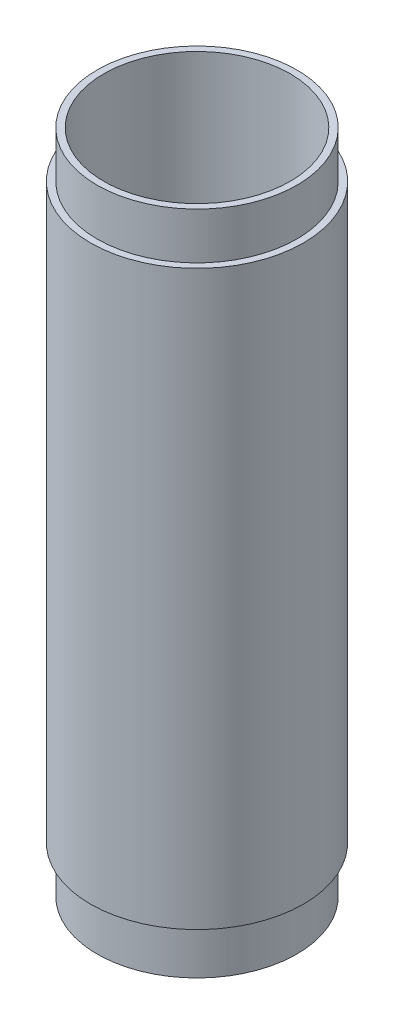
ISO-10303-21;
HEADER;
FILE_DESCRIPTION(('STEP AP214'),'2;1');
FILE_NAME('part.step','',(''),(''),'','','');
FILE_SCHEMA(('AUTOMOTIVE_DESIGN { 1 0 10303 214 1 1 1 1 }'));
ENDSEC;
DATA;
#1=APPLICATION_CONTEXT('core data for automotive mechanical design processes');
#2=APPLICATION_PROTOCOL_DEFINITION('international standard','automotive_design',2000,#1);
#3=PRODUCT_CONTEXT('',#1,'mechanical');
#4=PRODUCT('Part','Part','',(#3));
#5=PRODUCT_RELATED_PRODUCT_CATEGORY('part','',(#4));
#6=PRODUCT_DEFINITION_FORMATION('','',#4);
#7=PRODUCT_DEFINITION_CONTEXT('part definition',#1,'design');
#8=PRODUCT_DEFINITION('design','',#6,#7);
#9=PRODUCT_DEFINITION_SHAPE('','',#8);
#10=(LENGTH_UNIT() NAMED_UNIT(*) SI_UNIT(.MILLI.,.METRE.));
#11=(NAMED_UNIT(*) PLANE_ANGLE_UNIT() SI_UNIT($,.RADIAN.));
#12=(NAMED_UNIT(*) SI_UNIT($,.STERADIAN.) SOLID_ANGLE_UNIT());
#13=UNCERTAINTY_MEASURE_WITH_UNIT(LENGTH_MEASURE(1.E-05),#10,'distance_accuracy_value','');
#14=(GEOMETRIC_REPRESENTATION_CONTEXT(3) GLOBAL_UNCERTAINTY_ASSIGNED_CONTEXT((#13)) GLOBAL_UNIT_ASSIGNED_CONTEXT((#10,
#11,#12)) REPRESENTATION_CONTEXT('',''));
#15=CARTESIAN_POINT('',(0.,0.,0.));
#16=DIRECTION('',(0.,0.,1.));
#17=DIRECTION('',(1.,0.,0.));
#18=AXIS2_PLACEMENT_3D('',#15,#16,#17);
#19=CARTESIAN_POINT('',(0.,100.,0.));
#20=DIRECTION('',(0.,-1.,0.));
#21=DIRECTION('',(0.,0.,-1.));
#22=AXIS2_PLACEMENT_3D('',#19,#20,#21);
#23=CYLINDRICAL_SURFACE('',#22,16.);
#24=CARTESIAN_POINT('',(0.,7.00000000000001,0.));
#25=DIRECTION('',(0.,-1.,0.));
#26=DIRECTION('',(0.,0.,-1.));
#27=AXIS2_PLACEMENT_3D('',#24,#25,#26);
#28=CIRCLE('',#27,16.);
#29=CARTESIAN_POINT('',(0.,7.00000000000001,-16.));
#30=VERTEX_POINT('',#29);
#31=EDGE_CURVE('E18',#30,#30,#28,.T.);
#32=ORIENTED_EDGE('',*,*,#31,.F.);
#33=EDGE_LOOP('',(#32));
#34=FACE_BOUND('',#33,.T.);
#35=CARTESIAN_POINT('',(0.,93.,0.));
#36=DIRECTION('',(0.,-1.,0.));
#37=DIRECTION('',(0.,0.,-1.));
#38=AXIS2_PLACEMENT_3D('',#35,#36,#37);
#39=CIRCLE('',#38,16.);
#40=CARTESIAN_POINT('',(0.,93.,-16.));
#41=VERTEX_POINT('',#40);
#42=EDGE_CURVE('E40',#41,#41,#39,.F.);
#43=ORIENTED_EDGE('',*,*,#42,.F.);
#44=EDGE_LOOP('',(#43));
#45=FACE_BOUND('',#44,.T.);
#46=ADVANCED_FACE('F15',(#34,#45),#23,.T.);
#47=CARTESIAN_POINT('',(0.,7.,0.));
#48=DIRECTION('',(0.,-1.,0.));
#49=DIRECTION('',(0.,0.,-1.));
#50=AXIS2_PLACEMENT_3D('',#47,#48,#49);
#51=PLANE('',#50);
#52=ORIENTED_EDGE('',*,*,#31,.T.);
#53=EDGE_LOOP('',(#52));
#54=FACE_BOUND('',#53,.T.);
#55=CARTESIAN_POINT('',(0.,7.,0.));
#56=DIRECTION('',(0.,-1.,0.));
#57=DIRECTION('',(0.,0.,-1.));
#58=AXIS2_PLACEMENT_3D('',#55,#56,#57);
#59=CIRCLE('',#58,15.);
#60=CARTESIAN_POINT('',(0.,7.,-15.));
#61=VERTEX_POINT('',#60);
#62=EDGE_CURVE('E38',#61,#61,#59,.T.);
#63=ORIENTED_EDGE('',*,*,#62,.F.);
#64=EDGE_LOOP('',(#63));
#65=FACE_BOUND('',#64,.T.);
#66=ADVANCED_FACE('F47',(#54,#65),#51,.T.);
#67=CARTESIAN_POINT('',(0.,93.,0.));
#68=DIRECTION('',(0.,1.,0.));
#69=DIRECTION('',(0.,0.,1.));
#70=AXIS2_PLACEMENT_3D('',#67,#68,#69);
#71=PLANE('',#70);
#72=ORIENTED_EDGE('',*,*,#42,.T.);
#73=EDGE_LOOP('',(#72));
#74=FACE_BOUND('',#73,.T.);
#75=CARTESIAN_POINT('',(0.,93.,0.));
#76=DIRECTION('',(0.,1.,0.));
#77=DIRECTION('',(0.,0.,1.));
#78=AXIS2_PLACEMENT_3D('',#75,#76,#77);
#79=CIRCLE('',#78,15.);
#80=CARTESIAN_POINT('',(0.,93.,15.));
#81=VERTEX_POINT('',#80);
#82=EDGE_CURVE('E35',#81,#81,#79,.T.);
#83=ORIENTED_EDGE('',*,*,#82,.F.);
#84=EDGE_LOOP('',(#83));
#85=FACE_BOUND('',#84,.T.);
#86=ADVANCED_FACE('F55',(#74,#85),#71,.T.);
#87=CARTESIAN_POINT('',(0.,7.,0.));
#88=DIRECTION('',(0.,-1.,0.));
#89=DIRECTION('',(0.,0.,-1.));
#90=AXIS2_PLACEMENT_3D('',#87,#88,#89);
#91=CYLINDRICAL_SURFACE('',#90,15.);
#92=CARTESIAN_POINT('',(0.,0.,0.));
#93=DIRECTION('',(0.,-1.,0.));
#94=DIRECTION('',(0.,0.,-1.));
#95=AXIS2_PLACEMENT_3D('',#92,#93,#94);
#96=CIRCLE('',#95,15.);
#97=CARTESIAN_POINT('',(0.,0.,-15.));
#98=VERTEX_POINT('',#97);
#99=EDGE_CURVE('E32',#98,#98,#96,.F.);
#100=ORIENTED_EDGE('',*,*,#99,.T.);
#101=EDGE_LOOP('',(#100));
#102=FACE_BOUND('',#101,.T.);
#103=ORIENTED_EDGE('',*,*,#62,.T.);
#104=EDGE_LOOP('',(#103));
#105=FACE_BOUND('',#104,.T.);
#106=ADVANCED_FACE('F76',(#102,#105),#91,.T.);
#107=CARTESIAN_POINT('',(0.,93.,0.));
#108=DIRECTION('',(0.,1.,0.));
#109=DIRECTION('',(0.,0.,1.));
#110=AXIS2_PLACEMENT_3D('',#107,#108,#109);
#111=CYLINDRICAL_SURFACE('',#110,15.);
#112=ORIENTED_EDGE('',*,*,#82,.T.);
#113=EDGE_LOOP('',(#112));
#114=FACE_BOUND('',#113,.T.);
#115=CARTESIAN_POINT('',(0.,100.,0.));
#116=DIRECTION('',(0.,1.,0.));
#117=DIRECTION('',(0.,0.,1.));
#118=AXIS2_PLACEMENT_3D('',#115,#116,#117);
#119=CIRCLE('',#118,15.);
#120=CARTESIAN_POINT('',(0.,100.,15.));
#121=VERTEX_POINT('',#120);
#122=EDGE_CURVE('E27',#121,#121,#119,.T.);
#123=ORIENTED_EDGE('',*,*,#122,.F.);
#124=EDGE_LOOP('',(#123));
#125=FACE_BOUND('',#124,.T.);
#126=ADVANCED_FACE('F72',(#114,#125),#111,.T.);
#127=CARTESIAN_POINT('',(0.,0.,0.));
#128=DIRECTION('',(0.,1.,0.));
#129=DIRECTION('',(0.,0.,1.));
#130=AXIS2_PLACEMENT_3D('',#127,#128,#129);
#131=PLANE('',#130);
#132=ORIENTED_EDGE('',*,*,#99,.F.);
#133=EDGE_LOOP('',(#132));
#134=FACE_BOUND('',#133,.T.);
#135=CARTESIAN_POINT('',(0.,0.,0.));
#136=DIRECTION('',(0.,-1.,0.));
#137=DIRECTION('',(0.,0.,-1.));
#138=AXIS2_PLACEMENT_3D('',#135,#136,#137);
#139=CIRCLE('',#138,14.);
#140=CARTESIAN_POINT('',(0.,0.,-14.));
#141=VERTEX_POINT('',#140);
#142=EDGE_CURVE('E22',#141,#141,#139,.F.);
#143=ORIENTED_EDGE('',*,*,#142,.T.);
#144=EDGE_LOOP('',(#143));
#145=FACE_BOUND('',#144,.T.);
#146=ADVANCED_FACE('F64',(#134,#145),#131,.F.);
#147=CARTESIAN_POINT('',(0.,100.,0.));
#148=DIRECTION('',(0.,1.,0.));
#149=DIRECTION('',(0.,0.,1.));
#150=AXIS2_PLACEMENT_3D('',#147,#148,#149);
#151=PLANE('',#150);
#152=ORIENTED_EDGE('',*,*,#122,.T.);
#153=EDGE_LOOP('',(#152));
#154=FACE_BOUND('',#153,.T.);
#155=CARTESIAN_POINT('',(0.,100.,0.));
#156=DIRECTION('',(0.,-1.,0.));
#157=DIRECTION('',(0.,0.,-1.));
#158=AXIS2_PLACEMENT_3D('',#155,#156,#157);
#159=CIRCLE('',#158,14.);
#160=CARTESIAN_POINT('',(0.,100.,-14.));
#161=VERTEX_POINT('',#160);
#162=EDGE_CURVE('E9',#161,#161,#159,.T.);
#163=ORIENTED_EDGE('',*,*,#162,.T.);
#164=EDGE_LOOP('',(#163));
#165=FACE_BOUND('',#164,.T.);
#166=ADVANCED_FACE('F58',(#154,#165),#151,.T.);
#167=CARTESIAN_POINT('',(0.,100.,0.));
#168=DIRECTION('',(0.,-1.,0.));
#169=DIRECTION('',(0.,0.,-1.));
#170=AXIS2_PLACEMENT_3D('',#167,#168,#169);
#171=CYLINDRICAL_SURFACE('',#170,14.);
#172=ORIENTED_EDGE('',*,*,#142,.F.);
#173=EDGE_LOOP('',(#172));
#174=FACE_BOUND('',#173,.T.);
#175=ORIENTED_EDGE('',*,*,#162,.F.);
#176=EDGE_LOOP('',(#175));
#177=FACE_BOUND('',#176,.T.);
#178=ADVANCED_FACE('F56',(#174,#177),#171,.F.);
#179=CLOSED_SHELL('',(#46,#66,#86,#106,#126,#146,#166,#178));
#180=MANIFOLD_SOLID_BREP('B1',#179);
#181=ADVANCED_BREP_SHAPE_REPRESENTATION('',(#18,#180),#14);
#182=SHAPE_DEFINITION_REPRESENTATION(#9,#181);
ENDSEC;
END-ISO-10303-21;
